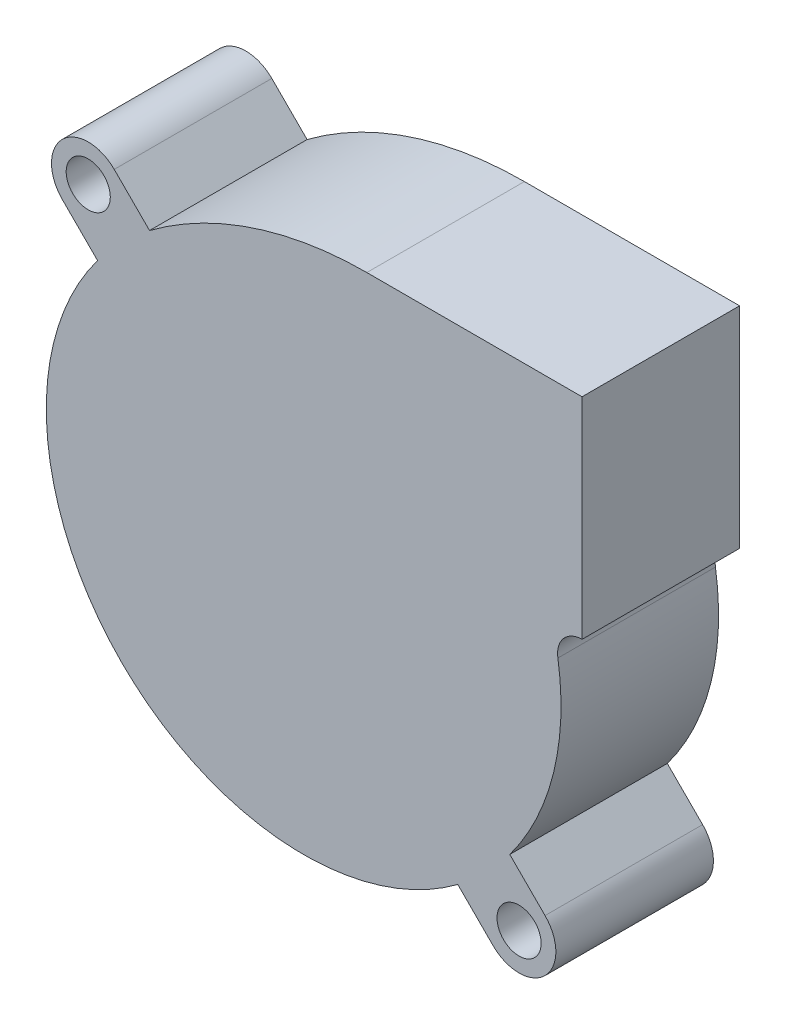
ISO-10303-21;
HEADER;
FILE_DESCRIPTION(('STEP AP214'),'2;1');
FILE_NAME('part.step','',(''),(''),'','','');
FILE_SCHEMA(('AUTOMOTIVE_DESIGN { 1 0 10303 214 1 1 1 1 }'));
ENDSEC;
DATA;
#1=APPLICATION_CONTEXT('core data for automotive mechanical design processes');
#2=APPLICATION_PROTOCOL_DEFINITION('international standard','automotive_design',2000,#1);
#3=PRODUCT_CONTEXT('',#1,'mechanical');
#4=PRODUCT('Part','Part','',(#3));
#5=PRODUCT_RELATED_PRODUCT_CATEGORY('part','',(#4));
#6=PRODUCT_DEFINITION_FORMATION('','',#4);
#7=PRODUCT_DEFINITION_CONTEXT('part definition',#1,'design');
#8=PRODUCT_DEFINITION('design','',#6,#7);
#9=PRODUCT_DEFINITION_SHAPE('','',#8);
#10=(LENGTH_UNIT() NAMED_UNIT(*) SI_UNIT(.MILLI.,.METRE.));
#11=(NAMED_UNIT(*) PLANE_ANGLE_UNIT() SI_UNIT($,.RADIAN.));
#12=(NAMED_UNIT(*) SI_UNIT($,.STERADIAN.) SOLID_ANGLE_UNIT());
#13=UNCERTAINTY_MEASURE_WITH_UNIT(LENGTH_MEASURE(1.E-05),#10,'distance_accuracy_value','');
#14=(GEOMETRIC_REPRESENTATION_CONTEXT(3) GLOBAL_UNCERTAINTY_ASSIGNED_CONTEXT((#13)) GLOBAL_UNIT_ASSIGNED_CONTEXT((#10,
#11,#12)) REPRESENTATION_CONTEXT('',''));
#15=CARTESIAN_POINT('',(0.,0.,0.));
#16=DIRECTION('',(0.,0.,1.));
#17=DIRECTION('',(1.,0.,0.));
#18=AXIS2_PLACEMENT_3D('',#15,#16,#17);
#19=CARTESIAN_POINT('',(0.,0.,15.));
#20=DIRECTION('',(0.,0.,1.));
#21=DIRECTION('',(1.,0.,0.));
#22=AXIS2_PLACEMENT_3D('',#19,#20,#21);
#23=PLANE('',#22);
#24=CARTESIAN_POINT('',(-20.5060966544098,20.5060966544099,15.));
#25=DIRECTION('',(0.,0.,1.));
#26=DIRECTION('',(1.,0.,0.));
#27=AXIS2_PLACEMENT_3D('',#24,#25,#26);
#28=CIRCLE('',#27,2.1);
#29=CARTESIAN_POINT('',(-18.4060966544098,20.5060966544099,15.));
#30=VERTEX_POINT('',#29);
#31=EDGE_CURVE('E157',#30,#30,#28,.T.);
#32=ORIENTED_EDGE('',*,*,#31,.F.);
#33=EDGE_LOOP('',(#32));
#34=FACE_BOUND('',#33,.T.);
#35=CARTESIAN_POINT('',(0.,0.,15.));
#36=DIRECTION('',(0.,0.,1.));
#37=DIRECTION('',(1.,0.,0.));
#38=AXIS2_PLACEMENT_3D('',#35,#36,#37);
#39=CIRCLE('',#38,24.5);
#40=CARTESIAN_POINT('',(-19.6213019336351,14.6715544653294,15.));
#41=VERTEX_POINT('',#40);
#42=CARTESIAN_POINT('',(14.6715544653293,-19.6213019336352,15.));
#43=VERTEX_POINT('',#42);
#44=EDGE_CURVE('E176',#41,#43,#39,.T.);
#45=ORIENTED_EDGE('',*,*,#44,.T.);
#46=DIRECTION('',(0.707106781186547,-0.707106781186548,0.));
#47=VECTOR('',#46,1.);
#48=CARTESIAN_POINT('',(14.6715544653293,-19.6213019336352,15.));
#49=LINE('',#48,#47);
#50=CARTESIAN_POINT('',(18.0312229202569,-22.9809703885628,15.));
#51=VERTEX_POINT('',#50);
#52=EDGE_CURVE('E104',#43,#51,#49,.T.);
#53=ORIENTED_EDGE('',*,*,#52,.T.);
#54=CARTESIAN_POINT('',(20.5060966544099,-20.5060966544099,15.));
#55=DIRECTION('',(0.,0.,1.));
#56=DIRECTION('',(1.,0.,0.));
#57=AXIS2_PLACEMENT_3D('',#54,#55,#56);
#58=CIRCLE('',#57,3.5);
#59=CARTESIAN_POINT('',(22.9809703885628,-18.031222920257,15.));
#60=VERTEX_POINT('',#59);
#61=EDGE_CURVE('E203',#51,#60,#58,.T.);
#62=ORIENTED_EDGE('',*,*,#61,.T.);
#63=DIRECTION('',(-0.707106781186547,0.707106781186548,0.));
#64=VECTOR('',#63,1.);
#65=CARTESIAN_POINT('',(22.9809703885628,-18.031222920257,15.));
#66=LINE('',#65,#64);
#67=CARTESIAN_POINT('',(19.6213019336351,-14.6715544653294,15.));
#68=VERTEX_POINT('',#67);
#69=EDGE_CURVE('E222',#60,#68,#66,.T.);
#70=ORIENTED_EDGE('',*,*,#69,.T.);
#71=CARTESIAN_POINT('',(0.,0.,15.));
#72=DIRECTION('',(0.,0.,1.));
#73=DIRECTION('',(1.,0.,0.));
#74=AXIS2_PLACEMENT_3D('',#71,#72,#73);
#75=CIRCLE('',#74,24.5);
#76=CARTESIAN_POINT('',(24.201713512701,3.8114384488201,15.));
#77=VERTEX_POINT('',#76);
#78=EDGE_CURVE('E219',#68,#77,#75,.T.);
#79=ORIENTED_EDGE('',*,*,#78,.T.);
#80=CARTESIAN_POINT('',(26.5,4.17338709677421,15.));
#81=DIRECTION('',(0.,0.,-1.));
#82=DIRECTION('',(1.,0.,0.));
#83=AXIS2_PLACEMENT_3D('',#80,#81,#82);
#84=CIRCLE('',#83,2.3266129032258);
#85=CARTESIAN_POINT('',(26.5,6.5,15.));
#86=VERTEX_POINT('',#85);
#87=EDGE_CURVE('E221',#77,#86,#84,.T.);
#88=ORIENTED_EDGE('',*,*,#87,.T.);
#89=DIRECTION('',(0.,1.,0.));
#90=VECTOR('',#89,1.);
#91=CARTESIAN_POINT('',(26.5,26.5,15.));
#92=LINE('',#91,#90);
#93=CARTESIAN_POINT('',(26.5,26.5,15.));
#94=VERTEX_POINT('',#93);
#95=EDGE_CURVE('E224',#86,#94,#92,.T.);
#96=ORIENTED_EDGE('',*,*,#95,.T.);
#97=DIRECTION('',(-1.,0.,0.));
#98=VECTOR('',#97,1.);
#99=CARTESIAN_POINT('',(26.5,26.5,15.));
#100=LINE('',#99,#98);
#101=CARTESIAN_POINT('',(6.01453677425923,26.5,15.));
#102=VERTEX_POINT('',#101);
#103=EDGE_CURVE('E230',#94,#102,#100,.T.);
#104=ORIENTED_EDGE('',*,*,#103,.T.);
#105=CARTESIAN_POINT('',(6.01453677425924,-8.04366315222915,15.));
#106=DIRECTION('',(0.,0.,1.));
#107=DIRECTION('',(1.,0.,0.));
#108=AXIS2_PLACEMENT_3D('',#105,#106,#107);
#109=CIRCLE('',#108,34.5436631522292);
#110=CARTESIAN_POINT('',(-14.6715544653293,19.6213019336352,15.));
#111=VERTEX_POINT('',#110);
#112=EDGE_CURVE('E135',#102,#111,#109,.T.);
#113=ORIENTED_EDGE('',*,*,#112,.T.);
#114=DIRECTION('',(-0.707106781186549,0.707106781186546,0.));
#115=VECTOR('',#114,1.);
#116=CARTESIAN_POINT('',(-14.6715544653293,19.6213019336352,15.));
#117=LINE('',#116,#115);
#118=CARTESIAN_POINT('',(-18.0312229202569,22.9809703885628,15.));
#119=VERTEX_POINT('',#118);
#120=EDGE_CURVE('E129',#111,#119,#117,.T.);
#121=ORIENTED_EDGE('',*,*,#120,.T.);
#122=CARTESIAN_POINT('',(-20.5060966544098,20.5060966544099,15.));
#123=DIRECTION('',(0.,0.,1.));
#124=DIRECTION('',(1.,0.,0.));
#125=AXIS2_PLACEMENT_3D('',#122,#123,#124);
#126=CIRCLE('',#125,3.5);
#127=CARTESIAN_POINT('',(-22.9809703885628,18.031222920257,15.));
#128=VERTEX_POINT('',#127);
#129=EDGE_CURVE('E133',#119,#128,#126,.T.);
#130=ORIENTED_EDGE('',*,*,#129,.T.);
#131=DIRECTION('',(0.707106781186546,-0.707106781186549,0.));
#132=VECTOR('',#131,1.);
#133=CARTESIAN_POINT('',(-22.9809703885628,18.031222920257,15.));
#134=LINE('',#133,#132);
#135=EDGE_CURVE('E49',#128,#41,#134,.T.);
#136=ORIENTED_EDGE('',*,*,#135,.T.);
#137=EDGE_LOOP('',(#45,#53,#62,#70,#79,#88,#96,#104,#113,#121,#130,#136));
#138=FACE_BOUND('',#137,.T.);
#139=CARTESIAN_POINT('',(20.5060966544099,-20.5060966544099,15.));
#140=DIRECTION('',(0.,0.,1.));
#141=DIRECTION('',(1.,0.,0.));
#142=AXIS2_PLACEMENT_3D('',#139,#140,#141);
#143=CIRCLE('',#142,2.1);
#144=CARTESIAN_POINT('',(22.6060966544099,-20.5060966544099,15.));
#145=VERTEX_POINT('',#144);
#146=EDGE_CURVE('E273',#145,#145,#143,.T.);
#147=ORIENTED_EDGE('',*,*,#146,.F.);
#148=EDGE_LOOP('',(#147));
#149=FACE_BOUND('',#148,.T.);
#150=ADVANCED_FACE('F32',(#34,#138,#149),#23,.T.);
#151=CARTESIAN_POINT('',(0.,0.,0.));
#152=DIRECTION('',(0.,0.,1.));
#153=DIRECTION('',(1.,0.,0.));
#154=AXIS2_PLACEMENT_3D('',#151,#152,#153);
#155=PLANE('',#154);
#156=CARTESIAN_POINT('',(-20.5060966544098,20.5060966544099,0.));
#157=DIRECTION('',(0.,0.,1.));
#158=DIRECTION('',(1.,0.,0.));
#159=AXIS2_PLACEMENT_3D('',#156,#157,#158);
#160=CIRCLE('',#159,2.1);
#161=CARTESIAN_POINT('',(-18.4060966544098,20.5060966544099,0.));
#162=VERTEX_POINT('',#161);
#163=EDGE_CURVE('E278',#162,#162,#160,.T.);
#164=ORIENTED_EDGE('',*,*,#163,.T.);
#165=EDGE_LOOP('',(#164));
#166=FACE_BOUND('',#165,.T.);
#167=CARTESIAN_POINT('',(0.,0.,0.));
#168=DIRECTION('',(0.,0.,1.));
#169=DIRECTION('',(1.,0.,0.));
#170=AXIS2_PLACEMENT_3D('',#167,#168,#169);
#171=CIRCLE('',#170,24.5);
#172=CARTESIAN_POINT('',(-19.6213019336351,14.6715544653294,0.));
#173=VERTEX_POINT('',#172);
#174=CARTESIAN_POINT('',(14.6715544653293,-19.6213019336352,0.));
#175=VERTEX_POINT('',#174);
#176=EDGE_CURVE('E153',#173,#175,#171,.T.);
#177=ORIENTED_EDGE('',*,*,#176,.F.);
#178=DIRECTION('',(0.707106781186546,-0.707106781186549,0.));
#179=VECTOR('',#178,1.);
#180=CARTESIAN_POINT('',(-22.9809703885628,18.031222920257,0.));
#181=LINE('',#180,#179);
#182=CARTESIAN_POINT('',(-22.9809703885628,18.031222920257,0.));
#183=VERTEX_POINT('',#182);
#184=EDGE_CURVE('E96',#183,#173,#181,.T.);
#185=ORIENTED_EDGE('',*,*,#184,.F.);
#186=CARTESIAN_POINT('',(-20.5060966544098,20.5060966544099,0.));
#187=DIRECTION('',(0.,0.,1.));
#188=DIRECTION('',(1.,0.,0.));
#189=AXIS2_PLACEMENT_3D('',#186,#187,#188);
#190=CIRCLE('',#189,3.5);
#191=CARTESIAN_POINT('',(-18.0312229202569,22.9809703885628,0.));
#192=VERTEX_POINT('',#191);
#193=EDGE_CURVE('E90',#192,#183,#190,.T.);
#194=ORIENTED_EDGE('',*,*,#193,.F.);
#195=DIRECTION('',(-0.707106781186549,0.707106781186546,0.));
#196=VECTOR('',#195,1.);
#197=CARTESIAN_POINT('',(-14.6715544653293,19.6213019336352,0.));
#198=LINE('',#197,#196);
#199=CARTESIAN_POINT('',(-14.6715544653293,19.6213019336352,0.));
#200=VERTEX_POINT('',#199);
#201=EDGE_CURVE('E143',#200,#192,#198,.T.);
#202=ORIENTED_EDGE('',*,*,#201,.F.);
#203=CARTESIAN_POINT('',(6.01453677425924,-8.04366315222915,0.));
#204=DIRECTION('',(0.,0.,1.));
#205=DIRECTION('',(1.,0.,0.));
#206=AXIS2_PLACEMENT_3D('',#203,#204,#205);
#207=CIRCLE('',#206,34.5436631522292);
#208=CARTESIAN_POINT('',(6.01453677425923,26.5,0.));
#209=VERTEX_POINT('',#208);
#210=EDGE_CURVE('E171',#209,#200,#207,.T.);
#211=ORIENTED_EDGE('',*,*,#210,.F.);
#212=DIRECTION('',(-1.,0.,0.));
#213=VECTOR('',#212,1.);
#214=CARTESIAN_POINT('',(26.5,26.5,0.));
#215=LINE('',#214,#213);
#216=CARTESIAN_POINT('',(26.5,26.5,0.));
#217=VERTEX_POINT('',#216);
#218=EDGE_CURVE('E169',#217,#209,#215,.T.);
#219=ORIENTED_EDGE('',*,*,#218,.F.);
#220=DIRECTION('',(0.,1.,0.));
#221=VECTOR('',#220,1.);
#222=CARTESIAN_POINT('',(26.5,26.5,0.));
#223=LINE('',#222,#221);
#224=CARTESIAN_POINT('',(26.5,6.5,0.));
#225=VERTEX_POINT('',#224);
#226=EDGE_CURVE('E167',#225,#217,#223,.T.);
#227=ORIENTED_EDGE('',*,*,#226,.F.);
#228=CARTESIAN_POINT('',(26.5,4.17338709677421,0.));
#229=DIRECTION('',(0.,0.,-1.));
#230=DIRECTION('',(1.,0.,0.));
#231=AXIS2_PLACEMENT_3D('',#228,#229,#230);
#232=CIRCLE('',#231,2.3266129032258);
#233=CARTESIAN_POINT('',(24.201713512701,3.8114384488201,0.));
#234=VERTEX_POINT('',#233);
#235=EDGE_CURVE('E165',#234,#225,#232,.T.);
#236=ORIENTED_EDGE('',*,*,#235,.F.);
#237=CARTESIAN_POINT('',(0.,0.,0.));
#238=DIRECTION('',(0.,0.,1.));
#239=DIRECTION('',(1.,0.,0.));
#240=AXIS2_PLACEMENT_3D('',#237,#238,#239);
#241=CIRCLE('',#240,24.5);
#242=CARTESIAN_POINT('',(19.6213019336351,-14.6715544653294,0.));
#243=VERTEX_POINT('',#242);
#244=EDGE_CURVE('E163',#243,#234,#241,.T.);
#245=ORIENTED_EDGE('',*,*,#244,.F.);
#246=DIRECTION('',(-0.707106781186547,0.707106781186548,0.));
#247=VECTOR('',#246,1.);
#248=CARTESIAN_POINT('',(22.9809703885628,-18.031222920257,0.));
#249=LINE('',#248,#247);
#250=CARTESIAN_POINT('',(22.9809703885628,-18.031222920257,0.));
#251=VERTEX_POINT('',#250);
#252=EDGE_CURVE('E161',#251,#243,#249,.T.);
#253=ORIENTED_EDGE('',*,*,#252,.F.);
#254=CARTESIAN_POINT('',(20.5060966544099,-20.5060966544099,0.));
#255=DIRECTION('',(0.,0.,1.));
#256=DIRECTION('',(1.,0.,0.));
#257=AXIS2_PLACEMENT_3D('',#254,#255,#256);
#258=CIRCLE('',#257,3.5);
#259=CARTESIAN_POINT('',(18.0312229202569,-22.9809703885628,0.));
#260=VERTEX_POINT('',#259);
#261=EDGE_CURVE('E159',#260,#251,#258,.T.);
#262=ORIENTED_EDGE('',*,*,#261,.F.);
#263=DIRECTION('',(0.707106781186547,-0.707106781186548,0.));
#264=VECTOR('',#263,1.);
#265=CARTESIAN_POINT('',(14.6715544653293,-19.6213019336352,0.));
#266=LINE('',#265,#264);
#267=EDGE_CURVE('E156',#175,#260,#266,.T.);
#268=ORIENTED_EDGE('',*,*,#267,.F.);
#269=EDGE_LOOP('',(#177,#185,#194,#202,#211,#219,#227,#236,#245,#253,#262,#268));
#270=FACE_BOUND('',#269,.T.);
#271=CARTESIAN_POINT('',(20.5060966544099,-20.5060966544099,0.));
#272=DIRECTION('',(0.,0.,1.));
#273=DIRECTION('',(1.,0.,0.));
#274=AXIS2_PLACEMENT_3D('',#271,#272,#273);
#275=CIRCLE('',#274,2.1);
#276=CARTESIAN_POINT('',(22.6060966544099,-20.5060966544099,0.));
#277=VERTEX_POINT('',#276);
#278=EDGE_CURVE('E276',#277,#277,#275,.T.);
#279=ORIENTED_EDGE('',*,*,#278,.T.);
#280=EDGE_LOOP('',(#279));
#281=FACE_BOUND('',#280,.T.);
#282=ADVANCED_FACE('F207',(#166,#270,#281),#155,.F.);
#283=CARTESIAN_POINT('',(0.,0.,15.));
#284=DIRECTION('',(0.,0.,-1.));
#285=DIRECTION('',(-1.,0.,0.));
#286=AXIS2_PLACEMENT_3D('',#283,#284,#285);
#287=CYLINDRICAL_SURFACE('',#286,24.5);
#288=ORIENTED_EDGE('',*,*,#176,.T.);
#289=DIRECTION('',(0.,0.,-1.));
#290=VECTOR('',#289,1.);
#291=CARTESIAN_POINT('',(14.6715544653293,-19.6213019336352,15.));
#292=LINE('',#291,#290);
#293=EDGE_CURVE('E11',#43,#175,#292,.T.);
#294=ORIENTED_EDGE('',*,*,#293,.F.);
#295=ORIENTED_EDGE('',*,*,#44,.F.);
#296=DIRECTION('',(0.,0.,-1.));
#297=VECTOR('',#296,1.);
#298=CARTESIAN_POINT('',(-19.6213019336351,14.6715544653294,15.));
#299=LINE('',#298,#297);
#300=EDGE_CURVE('E149',#41,#173,#299,.T.);
#301=ORIENTED_EDGE('',*,*,#300,.T.);
#302=EDGE_LOOP('',(#288,#294,#295,#301));
#303=FACE_BOUND('',#302,.T.);
#304=ADVANCED_FACE('F34',(#303),#287,.T.);
#305=CARTESIAN_POINT('',(14.6715544653293,-19.6213019336352,15.));
#306=DIRECTION('',(0.707106781186549,0.707106781186547,0.));
#307=DIRECTION('',(-0.707106781186547,0.707106781186549,0.));
#308=AXIS2_PLACEMENT_3D('',#305,#306,#307);
#309=PLANE('',#308);
#310=ORIENTED_EDGE('',*,*,#267,.T.);
#311=DIRECTION('',(0.,0.,-1.));
#312=VECTOR('',#311,1.);
#313=CARTESIAN_POINT('',(18.0312229202569,-22.9809703885628,15.));
#314=LINE('',#313,#312);
#315=EDGE_CURVE('E41',#51,#260,#314,.T.);
#316=ORIENTED_EDGE('',*,*,#315,.F.);
#317=ORIENTED_EDGE('',*,*,#52,.F.);
#318=ORIENTED_EDGE('',*,*,#293,.T.);
#319=EDGE_LOOP('',(#310,#316,#317,#318));
#320=FACE_BOUND('',#319,.T.);
#321=ADVANCED_FACE('F371',(#320),#309,.F.);
#322=CARTESIAN_POINT('',(20.5060966544099,-20.5060966544099,15.));
#323=DIRECTION('',(0.,0.,-1.));
#324=DIRECTION('',(-1.,0.,0.));
#325=AXIS2_PLACEMENT_3D('',#322,#323,#324);
#326=CYLINDRICAL_SURFACE('',#325,3.5);
#327=ORIENTED_EDGE('',*,*,#261,.T.);
#328=DIRECTION('',(0.,0.,-1.));
#329=VECTOR('',#328,1.);
#330=CARTESIAN_POINT('',(22.9809703885628,-18.031222920257,15.));
#331=LINE('',#330,#329);
#332=EDGE_CURVE('E195',#60,#251,#331,.T.);
#333=ORIENTED_EDGE('',*,*,#332,.F.);
#334=ORIENTED_EDGE('',*,*,#61,.F.);
#335=ORIENTED_EDGE('',*,*,#315,.T.);
#336=EDGE_LOOP('',(#327,#333,#334,#335));
#337=FACE_BOUND('',#336,.T.);
#338=ADVANCED_FACE('F201',(#337),#326,.T.);
#339=CARTESIAN_POINT('',(22.9809703885628,-18.031222920257,15.));
#340=DIRECTION('',(-0.707106781186548,-0.707106781186547,0.));
#341=DIRECTION('',(0.707106781186547,-0.707106781186548,0.));
#342=AXIS2_PLACEMENT_3D('',#339,#340,#341);
#343=PLANE('',#342);
#344=ORIENTED_EDGE('',*,*,#252,.T.);
#345=DIRECTION('',(0.,0.,-1.));
#346=VECTOR('',#345,1.);
#347=CARTESIAN_POINT('',(19.6213019336351,-14.6715544653294,15.));
#348=LINE('',#347,#346);
#349=EDGE_CURVE('E192',#68,#243,#348,.T.);
#350=ORIENTED_EDGE('',*,*,#349,.F.);
#351=ORIENTED_EDGE('',*,*,#69,.F.);
#352=ORIENTED_EDGE('',*,*,#332,.T.);
#353=EDGE_LOOP('',(#344,#350,#351,#352));
#354=FACE_BOUND('',#353,.T.);
#355=ADVANCED_FACE('F213',(#354),#343,.F.);
#356=CARTESIAN_POINT('',(0.,0.,15.));
#357=DIRECTION('',(0.,0.,-1.));
#358=DIRECTION('',(-1.,0.,0.));
#359=AXIS2_PLACEMENT_3D('',#356,#357,#358);
#360=CYLINDRICAL_SURFACE('',#359,24.5);
#361=ORIENTED_EDGE('',*,*,#244,.T.);
#362=DIRECTION('',(0.,0.,-1.));
#363=VECTOR('',#362,1.);
#364=CARTESIAN_POINT('',(24.201713512701,3.8114384488201,15.));
#365=LINE('',#364,#363);
#366=EDGE_CURVE('E189',#77,#234,#365,.T.);
#367=ORIENTED_EDGE('',*,*,#366,.F.);
#368=ORIENTED_EDGE('',*,*,#78,.F.);
#369=ORIENTED_EDGE('',*,*,#349,.T.);
#370=EDGE_LOOP('',(#361,#367,#368,#369));
#371=FACE_BOUND('',#370,.T.);
#372=ADVANCED_FACE('F217',(#371),#360,.T.);
#373=CARTESIAN_POINT('',(26.5,4.17338709677421,15.));
#374=DIRECTION('',(0.,0.,-1.));
#375=DIRECTION('',(-1.,0.,0.));
#376=AXIS2_PLACEMENT_3D('',#373,#374,#375);
#377=CYLINDRICAL_SURFACE('',#376,2.3266129032258);
#378=ORIENTED_EDGE('',*,*,#235,.T.);
#379=DIRECTION('',(0.,0.,-1.));
#380=VECTOR('',#379,1.);
#381=CARTESIAN_POINT('',(26.5,6.5,15.));
#382=LINE('',#381,#380);
#383=EDGE_CURVE('E186',#86,#225,#382,.T.);
#384=ORIENTED_EDGE('',*,*,#383,.F.);
#385=ORIENTED_EDGE('',*,*,#87,.F.);
#386=ORIENTED_EDGE('',*,*,#366,.T.);
#387=EDGE_LOOP('',(#378,#384,#385,#386));
#388=FACE_BOUND('',#387,.T.);
#389=ADVANCED_FACE('F336',(#388),#377,.F.);
#390=CARTESIAN_POINT('',(26.5,26.5,15.));
#391=DIRECTION('',(-1.,0.,0.));
#392=DIRECTION('',(0.,-1.,0.));
#393=AXIS2_PLACEMENT_3D('',#390,#391,#392);
#394=PLANE('',#393);
#395=ORIENTED_EDGE('',*,*,#226,.T.);
#396=DIRECTION('',(0.,0.,-1.));
#397=VECTOR('',#396,1.);
#398=CARTESIAN_POINT('',(26.5,26.5,15.));
#399=LINE('',#398,#397);
#400=EDGE_CURVE('E183',#94,#217,#399,.T.);
#401=ORIENTED_EDGE('',*,*,#400,.F.);
#402=ORIENTED_EDGE('',*,*,#95,.F.);
#403=ORIENTED_EDGE('',*,*,#383,.T.);
#404=EDGE_LOOP('',(#395,#401,#402,#403));
#405=FACE_BOUND('',#404,.T.);
#406=ADVANCED_FACE('F327',(#405),#394,.F.);
#407=CARTESIAN_POINT('',(26.5,26.5,15.));
#408=DIRECTION('',(0.,-1.,0.));
#409=DIRECTION('',(1.,0.,0.));
#410=AXIS2_PLACEMENT_3D('',#407,#408,#409);
#411=PLANE('',#410);
#412=ORIENTED_EDGE('',*,*,#218,.T.);
#413=DIRECTION('',(0.,0.,-1.));
#414=VECTOR('',#413,1.);
#415=CARTESIAN_POINT('',(6.01453677425923,26.5,15.));
#416=LINE('',#415,#414);
#417=EDGE_CURVE('E180',#102,#209,#416,.T.);
#418=ORIENTED_EDGE('',*,*,#417,.F.);
#419=ORIENTED_EDGE('',*,*,#103,.F.);
#420=ORIENTED_EDGE('',*,*,#400,.T.);
#421=EDGE_LOOP('',(#412,#418,#419,#420));
#422=FACE_BOUND('',#421,.T.);
#423=ADVANCED_FACE('F236',(#422),#411,.F.);
#424=CARTESIAN_POINT('',(6.01453677425924,-8.04366315222915,15.));
#425=DIRECTION('',(0.,0.,-1.));
#426=DIRECTION('',(-1.,0.,0.));
#427=AXIS2_PLACEMENT_3D('',#424,#425,#426);
#428=CYLINDRICAL_SURFACE('',#427,34.5436631522292);
#429=ORIENTED_EDGE('',*,*,#210,.T.);
#430=DIRECTION('',(0.,0.,-1.));
#431=VECTOR('',#430,1.);
#432=CARTESIAN_POINT('',(-14.6715544653293,19.6213019336352,15.));
#433=LINE('',#432,#431);
#434=EDGE_CURVE('E144',#111,#200,#433,.T.);
#435=ORIENTED_EDGE('',*,*,#434,.F.);
#436=ORIENTED_EDGE('',*,*,#112,.F.);
#437=ORIENTED_EDGE('',*,*,#417,.T.);
#438=EDGE_LOOP('',(#429,#435,#436,#437));
#439=FACE_BOUND('',#438,.T.);
#440=ADVANCED_FACE('F240',(#439),#428,.T.);
#441=CARTESIAN_POINT('',(-14.6715544653293,19.6213019336352,15.));
#442=DIRECTION('',(-0.707106781186546,-0.707106781186549,0.));
#443=DIRECTION('',(0.707106781186549,-0.707106781186546,0.));
#444=AXIS2_PLACEMENT_3D('',#441,#442,#443);
#445=PLANE('',#444);
#446=ORIENTED_EDGE('',*,*,#201,.T.);
#447=DIRECTION('',(0.,0.,-1.));
#448=VECTOR('',#447,1.);
#449=CARTESIAN_POINT('',(-18.0312229202569,22.9809703885628,15.));
#450=LINE('',#449,#448);
#451=EDGE_CURVE('E140',#119,#192,#450,.T.);
#452=ORIENTED_EDGE('',*,*,#451,.F.);
#453=ORIENTED_EDGE('',*,*,#120,.F.);
#454=ORIENTED_EDGE('',*,*,#434,.T.);
#455=EDGE_LOOP('',(#446,#452,#453,#454));
#456=FACE_BOUND('',#455,.T.);
#457=ADVANCED_FACE('F141',(#456),#445,.F.);
#458=CARTESIAN_POINT('',(-20.5060966544098,20.5060966544099,15.));
#459=DIRECTION('',(0.,0.,-1.));
#460=DIRECTION('',(-1.,0.,0.));
#461=AXIS2_PLACEMENT_3D('',#458,#459,#460);
#462=CYLINDRICAL_SURFACE('',#461,3.5);
#463=ORIENTED_EDGE('',*,*,#193,.T.);
#464=DIRECTION('',(0.,0.,-1.));
#465=VECTOR('',#464,1.);
#466=CARTESIAN_POINT('',(-22.9809703885628,18.031222920257,15.));
#467=LINE('',#466,#465);
#468=EDGE_CURVE('E145',#128,#183,#467,.T.);
#469=ORIENTED_EDGE('',*,*,#468,.F.);
#470=ORIENTED_EDGE('',*,*,#129,.F.);
#471=ORIENTED_EDGE('',*,*,#451,.T.);
#472=EDGE_LOOP('',(#463,#469,#470,#471));
#473=FACE_BOUND('',#472,.T.);
#474=ADVANCED_FACE('F147',(#473),#462,.T.);
#475=CARTESIAN_POINT('',(-22.9809703885628,18.031222920257,15.));
#476=DIRECTION('',(0.707106781186549,0.707106781186546,0.));
#477=DIRECTION('',(-0.707106781186546,0.707106781186549,0.));
#478=AXIS2_PLACEMENT_3D('',#475,#476,#477);
#479=PLANE('',#478);
#480=ORIENTED_EDGE('',*,*,#184,.T.);
#481=ORIENTED_EDGE('',*,*,#300,.F.);
#482=ORIENTED_EDGE('',*,*,#135,.F.);
#483=ORIENTED_EDGE('',*,*,#468,.T.);
#484=EDGE_LOOP('',(#480,#481,#482,#483));
#485=FACE_BOUND('',#484,.T.);
#486=ADVANCED_FACE('F244',(#485),#479,.F.);
#487=CARTESIAN_POINT('',(-20.5060966544098,20.5060966544099,15.));
#488=DIRECTION('',(0.,0.,-1.));
#489=DIRECTION('',(-1.,0.,0.));
#490=AXIS2_PLACEMENT_3D('',#487,#488,#489);
#491=CYLINDRICAL_SURFACE('',#490,2.1);
#492=ORIENTED_EDGE('',*,*,#31,.T.);
#493=EDGE_LOOP('',(#492));
#494=FACE_BOUND('',#493,.T.);
#495=ORIENTED_EDGE('',*,*,#163,.F.);
#496=EDGE_LOOP('',(#495));
#497=FACE_BOUND('',#496,.T.);
#498=ADVANCED_FACE('F246',(#494,#497),#491,.F.);
#499=CARTESIAN_POINT('',(20.5060966544099,-20.5060966544099,15.));
#500=DIRECTION('',(0.,0.,-1.));
#501=DIRECTION('',(-1.,0.,0.));
#502=AXIS2_PLACEMENT_3D('',#499,#500,#501);
#503=CYLINDRICAL_SURFACE('',#502,2.1);
#504=ORIENTED_EDGE('',*,*,#146,.T.);
#505=EDGE_LOOP('',(#504));
#506=FACE_BOUND('',#505,.T.);
#507=ORIENTED_EDGE('',*,*,#278,.F.);
#508=EDGE_LOOP('',(#507));
#509=FACE_BOUND('',#508,.T.);
#510=ADVANCED_FACE('F252',(#506,#509),#503,.F.);
#511=CLOSED_SHELL('',(#150,#282,#304,#321,#338,#355,#372,#389,#406,#423,#440,#457,#474,#486,
#498,#510));
#512=MANIFOLD_SOLID_BREP('B2',#511);
#513=ADVANCED_BREP_SHAPE_REPRESENTATION('',(#18,#512),#14);
#514=SHAPE_DEFINITION_REPRESENTATION(#9,#513);
ENDSEC;
END-ISO-10303-21;
